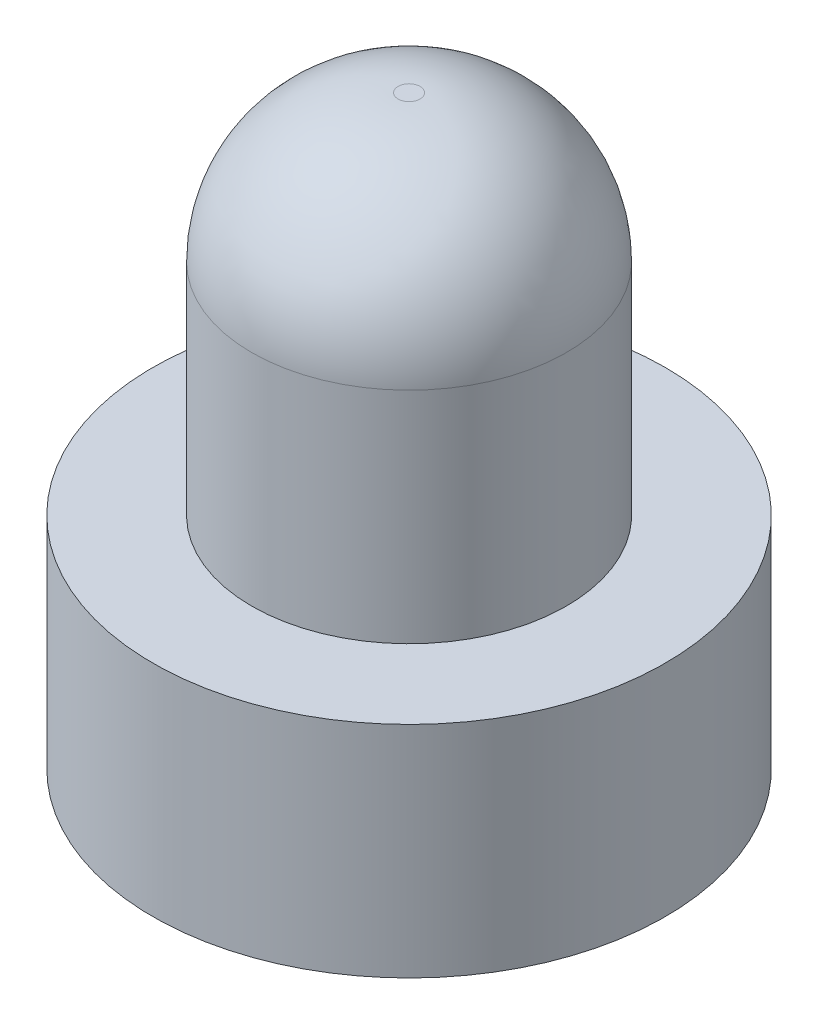
ISO-10303-21;
HEADER;
FILE_DESCRIPTION(('STEP AP214'),'2;1');
FILE_NAME('part.step','',(''),(''),'','','');
FILE_SCHEMA(('AUTOMOTIVE_DESIGN { 1 0 10303 214 1 1 1 1 }'));
ENDSEC;
DATA;
#1=APPLICATION_CONTEXT('core data for automotive mechanical design processes');
#2=APPLICATION_PROTOCOL_DEFINITION('international standard','automotive_design',2000,#1);
#3=PRODUCT_CONTEXT('',#1,'mechanical');
#4=PRODUCT('Part','Part','',(#3));
#5=PRODUCT_RELATED_PRODUCT_CATEGORY('part','',(#4));
#6=PRODUCT_DEFINITION_FORMATION('','',#4);
#7=PRODUCT_DEFINITION_CONTEXT('part definition',#1,'design');
#8=PRODUCT_DEFINITION('design','',#6,#7);
#9=PRODUCT_DEFINITION_SHAPE('','',#8);
#10=(LENGTH_UNIT() NAMED_UNIT(*) SI_UNIT(.MILLI.,.METRE.));
#11=(NAMED_UNIT(*) PLANE_ANGLE_UNIT() SI_UNIT($,.RADIAN.));
#12=(NAMED_UNIT(*) SI_UNIT($,.STERADIAN.) SOLID_ANGLE_UNIT());
#13=UNCERTAINTY_MEASURE_WITH_UNIT(LENGTH_MEASURE(1.E-05),#10,'distance_accuracy_value','');
#14=(GEOMETRIC_REPRESENTATION_CONTEXT(3) GLOBAL_UNCERTAINTY_ASSIGNED_CONTEXT((#13)) GLOBAL_UNIT_ASSIGNED_CONTEXT((#10,
#11,#12)) REPRESENTATION_CONTEXT('',''));
#15=CARTESIAN_POINT('',(0.,0.,0.));
#16=DIRECTION('',(0.,0.,1.));
#17=DIRECTION('',(1.,0.,0.));
#18=AXIS2_PLACEMENT_3D('',#15,#16,#17);
#19=CARTESIAN_POINT('',(0.,5.,0.));
#20=DIRECTION('',(0.,-1.,0.));
#21=DIRECTION('',(0.,0.,-1.));
#22=AXIS2_PLACEMENT_3D('',#19,#20,#21);
#23=CYLINDRICAL_SURFACE('',#22,2.15);
#24=CARTESIAN_POINT('',(0.,3.,0.));
#25=DIRECTION('',(0.,1.,0.));
#26=DIRECTION('',(0.,0.,1.));
#27=AXIS2_PLACEMENT_3D('',#24,#25,#26);
#28=CIRCLE('',#27,2.15);
#29=CARTESIAN_POINT('',(0.,3.,2.15));
#30=VERTEX_POINT('',#29);
#31=EDGE_CURVE('E10',#30,#30,#28,.F.);
#32=ORIENTED_EDGE('',*,*,#31,.T.);
#33=EDGE_LOOP('',(#32));
#34=FACE_BOUND('',#33,.T.);
#35=CARTESIAN_POINT('',(0.,0.,0.));
#36=DIRECTION('',(0.,1.,0.));
#37=DIRECTION('',(0.,0.,1.));
#38=AXIS2_PLACEMENT_3D('',#35,#36,#37);
#39=CIRCLE('',#38,2.15);
#40=CARTESIAN_POINT('',(0.,0.,2.15));
#41=VERTEX_POINT('',#40);
#42=EDGE_CURVE('E48',#41,#41,#39,.T.);
#43=ORIENTED_EDGE('',*,*,#42,.T.);
#44=EDGE_LOOP('',(#43));
#45=FACE_BOUND('',#44,.T.);
#46=ADVANCED_FACE('F37',(#34,#45),#23,.T.);
#47=CARTESIAN_POINT('',(0.,5.,0.));
#48=DIRECTION('',(0.,1.,0.));
#49=DIRECTION('',(0.,0.,1.));
#50=AXIS2_PLACEMENT_3D('',#47,#48,#49);
#51=PLANE('',#50);
#52=CARTESIAN_POINT('',(0.,5.,0.));
#53=DIRECTION('',(0.,1.,0.));
#54=DIRECTION('',(0.,0.,1.));
#55=AXIS2_PLACEMENT_3D('',#52,#53,#54);
#56=CIRCLE('',#55,0.15);
#57=CARTESIAN_POINT('',(0.,5.,0.15));
#58=VERTEX_POINT('',#57);
#59=EDGE_CURVE('E44',#58,#58,#56,.T.);
#60=ORIENTED_EDGE('',*,*,#59,.T.);
#61=EDGE_LOOP('',(#60));
#62=FACE_BOUND('',#61,.T.);
#63=ADVANCED_FACE('F85',(#62),#51,.T.);
#64=CARTESIAN_POINT('',(0.,-3.,0.));
#65=DIRECTION('',(0.,1.,0.));
#66=DIRECTION('',(0.,0.,1.));
#67=AXIS2_PLACEMENT_3D('',#64,#65,#66);
#68=CYLINDRICAL_SURFACE('',#67,3.5);
#69=CARTESIAN_POINT('',(0.,-3.,0.));
#70=DIRECTION('',(0.,-1.,0.));
#71=DIRECTION('',(0.,0.,-1.));
#72=AXIS2_PLACEMENT_3D('',#69,#70,#71);
#73=CIRCLE('',#72,3.5);
#74=CARTESIAN_POINT('',(0.,-3.,-3.5));
#75=VERTEX_POINT('',#74);
#76=EDGE_CURVE('E52',#75,#75,#73,.T.);
#77=ORIENTED_EDGE('',*,*,#76,.F.);
#78=EDGE_LOOP('',(#77));
#79=FACE_BOUND('',#78,.T.);
#80=CARTESIAN_POINT('',(0.,0.,0.));
#81=DIRECTION('',(0.,-1.,0.));
#82=DIRECTION('',(0.,0.,-1.));
#83=AXIS2_PLACEMENT_3D('',#80,#81,#82);
#84=CIRCLE('',#83,3.5);
#85=CARTESIAN_POINT('',(0.,0.,-3.5));
#86=VERTEX_POINT('',#85);
#87=EDGE_CURVE('E55',#86,#86,#84,.T.);
#88=ORIENTED_EDGE('',*,*,#87,.T.);
#89=EDGE_LOOP('',(#88));
#90=FACE_BOUND('',#89,.T.);
#91=ADVANCED_FACE('F79',(#79,#90),#68,.T.);
#92=CARTESIAN_POINT('',(0.,-3.,0.));
#93=DIRECTION('',(0.,-1.,0.));
#94=DIRECTION('',(0.,0.,-1.));
#95=AXIS2_PLACEMENT_3D('',#92,#93,#94);
#96=PLANE('',#95);
#97=CARTESIAN_POINT('',(0.,-3.,0.));
#98=DIRECTION('',(0.,-1.,0.));
#99=DIRECTION('',(0.,0.,-1.));
#100=AXIS2_PLACEMENT_3D('',#97,#98,#99);
#101=CIRCLE('',#100,2.);
#102=CARTESIAN_POINT('',(0.,-3.,-2.));
#103=VERTEX_POINT('',#102);
#104=EDGE_CURVE('E61',#103,#103,#101,.T.);
#105=ORIENTED_EDGE('',*,*,#104,.F.);
#106=EDGE_LOOP('',(#105));
#107=FACE_BOUND('',#106,.T.);
#108=ORIENTED_EDGE('',*,*,#76,.T.);
#109=EDGE_LOOP('',(#108));
#110=FACE_BOUND('',#109,.T.);
#111=ADVANCED_FACE('F76',(#107,#110),#96,.T.);
#112=CARTESIAN_POINT('',(0.,0.,0.));
#113=DIRECTION('',(0.,-1.,0.));
#114=DIRECTION('',(0.,0.,-1.));
#115=AXIS2_PLACEMENT_3D('',#112,#113,#114);
#116=PLANE('',#115);
#117=ORIENTED_EDGE('',*,*,#42,.F.);
#118=EDGE_LOOP('',(#117));
#119=FACE_BOUND('',#118,.T.);
#120=ORIENTED_EDGE('',*,*,#87,.F.);
#121=EDGE_LOOP('',(#120));
#122=FACE_BOUND('',#121,.T.);
#123=ADVANCED_FACE('F72',(#119,#122),#116,.F.);
#124=CARTESIAN_POINT('',(0.,0.,0.));
#125=DIRECTION('',(0.,-1.,0.));
#126=DIRECTION('',(0.,0.,-1.));
#127=AXIS2_PLACEMENT_3D('',#124,#125,#126);
#128=CYLINDRICAL_SURFACE('',#127,2.);
#129=CARTESIAN_POINT('',(0.,0.,0.));
#130=DIRECTION('',(0.,-1.,0.));
#131=DIRECTION('',(0.,0.,-1.));
#132=AXIS2_PLACEMENT_3D('',#129,#130,#131);
#133=CIRCLE('',#132,2.);
#134=CARTESIAN_POINT('',(0.,0.,-2.));
#135=VERTEX_POINT('',#134);
#136=EDGE_CURVE('E58',#135,#135,#133,.T.);
#137=ORIENTED_EDGE('',*,*,#136,.F.);
#138=EDGE_LOOP('',(#137));
#139=FACE_BOUND('',#138,.T.);
#140=ORIENTED_EDGE('',*,*,#104,.T.);
#141=EDGE_LOOP('',(#140));
#142=FACE_BOUND('',#141,.T.);
#143=ADVANCED_FACE('F69',(#139,#142),#128,.F.);
#144=CARTESIAN_POINT('',(0.,0.,0.));
#145=DIRECTION('',(0.,-1.,0.));
#146=DIRECTION('',(0.,0.,-1.));
#147=AXIS2_PLACEMENT_3D('',#144,#145,#146);
#148=PLANE('',#147);
#149=ORIENTED_EDGE('',*,*,#136,.T.);
#150=EDGE_LOOP('',(#149));
#151=FACE_BOUND('',#150,.T.);
#152=ADVANCED_FACE('F67',(#151),#148,.T.);
#153=CARTESIAN_POINT('',(0.,3.,0.));
#154=DIRECTION('',(0.,1.,0.));
#155=DIRECTION('',(0.,0.,1.));
#156=AXIS2_PLACEMENT_3D('',#153,#154,#155);
#157=DEGENERATE_TOROIDAL_SURFACE('',#156,0.15,2.,.T.);
#158=ORIENTED_EDGE('',*,*,#31,.F.);
#159=EDGE_LOOP('',(#158));
#160=FACE_BOUND('',#159,.T.);
#161=ORIENTED_EDGE('',*,*,#59,.F.);
#162=EDGE_LOOP('',(#161));
#163=FACE_BOUND('',#162,.T.);
#164=ADVANCED_FACE('F39',(#160,#163),#157,.T.);
#165=CLOSED_SHELL('',(#46,#63,#91,#111,#123,#143,#152,#164));
#166=MANIFOLD_SOLID_BREP('B2',#165);
#167=ADVANCED_BREP_SHAPE_REPRESENTATION('',(#18,#166),#14);
#168=SHAPE_DEFINITION_REPRESENTATION(#9,#167);
ENDSEC;
END-ISO-10303-21;
